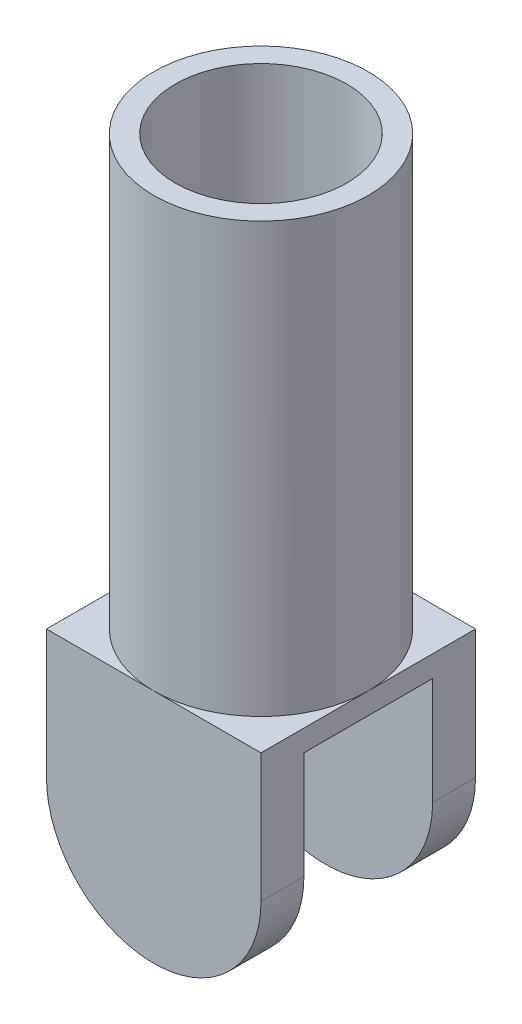
ISO-10303-21;
HEADER;
FILE_DESCRIPTION(('STEP AP214'),'2;1');
FILE_NAME('part.step','',(''),(''),'','','');
FILE_SCHEMA(('AUTOMOTIVE_DESIGN { 1 0 10303 214 1 1 1 1 }'));
ENDSEC;
DATA;
#1=APPLICATION_CONTEXT('core data for automotive mechanical design processes');
#2=APPLICATION_PROTOCOL_DEFINITION('international standard','automotive_design',2000,#1);
#3=PRODUCT_CONTEXT('',#1,'mechanical');
#4=PRODUCT('Part','Part','',(#3));
#5=PRODUCT_RELATED_PRODUCT_CATEGORY('part','',(#4));
#6=PRODUCT_DEFINITION_FORMATION('','',#4);
#7=PRODUCT_DEFINITION_CONTEXT('part definition',#1,'design');
#8=PRODUCT_DEFINITION('design','',#6,#7);
#9=PRODUCT_DEFINITION_SHAPE('','',#8);
#10=(LENGTH_UNIT() NAMED_UNIT(*) SI_UNIT(.MILLI.,.METRE.));
#11=(NAMED_UNIT(*) PLANE_ANGLE_UNIT() SI_UNIT($,.RADIAN.));
#12=(NAMED_UNIT(*) SI_UNIT($,.STERADIAN.) SOLID_ANGLE_UNIT());
#13=UNCERTAINTY_MEASURE_WITH_UNIT(LENGTH_MEASURE(1.E-05),#10,'distance_accuracy_value','');
#14=(GEOMETRIC_REPRESENTATION_CONTEXT(3) GLOBAL_UNCERTAINTY_ASSIGNED_CONTEXT((#13)) GLOBAL_UNIT_ASSIGNED_CONTEXT((#10,
#11,#12)) REPRESENTATION_CONTEXT('',''));
#15=CARTESIAN_POINT('',(0.,0.,0.));
#16=DIRECTION('',(0.,0.,1.));
#17=DIRECTION('',(1.,0.,0.));
#18=AXIS2_PLACEMENT_3D('',#15,#16,#17);
#19=CARTESIAN_POINT('',(-5.,11.,-5.));
#20=DIRECTION('',(1.,0.,0.));
#21=DIRECTION('',(0.,0.,-1.));
#22=AXIS2_PLACEMENT_3D('',#19,#20,#21);
#23=PLANE('',#22);
#24=DIRECTION('',(0.,0.,1.));
#25=VECTOR('',#24,1.);
#26=CARTESIAN_POINT('',(-5.,5.,-55.));
#27=LINE('',#26,#25);
#28=CARTESIAN_POINT('',(-5.,5.,3.));
#29=VERTEX_POINT('',#28);
#30=CARTESIAN_POINT('',(-5.,5.,5.));
#31=VERTEX_POINT('',#30);
#32=EDGE_CURVE('E50',#29,#31,#27,.T.);
#33=ORIENTED_EDGE('',*,*,#32,.T.);
#34=DIRECTION('',(0.,-1.,0.));
#35=VECTOR('',#34,1.);
#36=CARTESIAN_POINT('',(-5.,11.,5.));
#37=LINE('',#36,#35);
#38=CARTESIAN_POINT('',(-5.,11.,5.));
#39=VERTEX_POINT('',#38);
#40=EDGE_CURVE('E122',#39,#31,#37,.T.);
#41=ORIENTED_EDGE('',*,*,#40,.F.);
#42=DIRECTION('',(0.,0.,1.));
#43=VECTOR('',#42,1.);
#44=CARTESIAN_POINT('',(-5.,11.,-5.));
#45=LINE('',#44,#43);
#46=CARTESIAN_POINT('',(-5.,11.,0.));
#47=VERTEX_POINT('',#46);
#48=EDGE_CURVE('E157',#47,#39,#45,.T.);
#49=ORIENTED_EDGE('',*,*,#48,.F.);
#50=CARTESIAN_POINT('',(-5.,11.,-5.));
#51=VERTEX_POINT('',#50);
#52=EDGE_CURVE('E155',#51,#47,#45,.T.);
#53=ORIENTED_EDGE('',*,*,#52,.F.);
#54=DIRECTION('',(0.,-1.,0.));
#55=VECTOR('',#54,1.);
#56=CARTESIAN_POINT('',(-5.,11.,-5.));
#57=LINE('',#56,#55);
#58=CARTESIAN_POINT('',(-5.,5.,-5.00000000000001));
#59=VERTEX_POINT('',#58);
#60=EDGE_CURVE('E142',#51,#59,#57,.T.);
#61=ORIENTED_EDGE('',*,*,#60,.T.);
#62=CARTESIAN_POINT('',(-5.,5.,-3.00000000000002));
#63=VERTEX_POINT('',#62);
#64=EDGE_CURVE('E125',#59,#63,#27,.T.);
#65=ORIENTED_EDGE('',*,*,#64,.T.);
#66=DIRECTION('',(0.,1.,0.));
#67=VECTOR('',#66,1.);
#68=CARTESIAN_POINT('',(-5.,11.,-3.));
#69=LINE('',#68,#67);
#70=CARTESIAN_POINT('',(-5.00000000000002,10.,-3.));
#71=VERTEX_POINT('',#70);
#72=EDGE_CURVE('E172',#63,#71,#69,.T.);
#73=ORIENTED_EDGE('',*,*,#72,.T.);
#74=DIRECTION('',(0.,0.,1.));
#75=VECTOR('',#74,1.);
#76=CARTESIAN_POINT('',(-5.,10.,-5.));
#77=LINE('',#76,#75);
#78=CARTESIAN_POINT('',(-5.00000000000002,10.,3.));
#79=VERTEX_POINT('',#78);
#80=EDGE_CURVE('E167',#71,#79,#77,.T.);
#81=ORIENTED_EDGE('',*,*,#80,.T.);
#82=DIRECTION('',(0.,-1.,0.));
#83=VECTOR('',#82,1.);
#84=CARTESIAN_POINT('',(-5.,11.,3.));
#85=LINE('',#84,#83);
#86=EDGE_CURVE('E124',#79,#29,#85,.T.);
#87=ORIENTED_EDGE('',*,*,#86,.T.);
#88=EDGE_LOOP('',(#33,#41,#49,#53,#61,#65,#73,#81,#87));
#89=FACE_BOUND('',#88,.T.);
#90=ADVANCED_FACE('F36',(#89),#23,.F.);
#91=CARTESIAN_POINT('',(0.,11.,0.));
#92=DIRECTION('',(0.,1.,0.));
#93=DIRECTION('',(0.,0.,1.));
#94=AXIS2_PLACEMENT_3D('',#91,#92,#93);
#95=PLANE('',#94);
#96=CARTESIAN_POINT('',(0.,11.,0.));
#97=DIRECTION('',(0.,1.,0.));
#98=DIRECTION('',(0.,0.,1.));
#99=AXIS2_PLACEMENT_3D('',#96,#97,#98);
#100=CIRCLE('',#99,5.);
#101=CARTESIAN_POINT('',(0.,11.,5.));
#102=VERTEX_POINT('',#101);
#103=CARTESIAN_POINT('',(5.,11.,0.));
#104=VERTEX_POINT('',#103);
#105=EDGE_CURVE('E136',#102,#104,#100,.T.);
#106=ORIENTED_EDGE('',*,*,#105,.F.);
#107=DIRECTION('',(1.,0.,0.));
#108=VECTOR('',#107,1.);
#109=CARTESIAN_POINT('',(-5.,11.,5.));
#110=LINE('',#109,#108);
#111=CARTESIAN_POINT('',(5.,11.,5.));
#112=VERTEX_POINT('',#111);
#113=EDGE_CURVE('E154',#102,#112,#110,.T.);
#114=ORIENTED_EDGE('',*,*,#113,.T.);
#115=DIRECTION('',(0.,0.,-1.));
#116=VECTOR('',#115,1.);
#117=CARTESIAN_POINT('',(5.,11.,-5.));
#118=LINE('',#117,#116);
#119=EDGE_CURVE('E149',#112,#104,#118,.T.);
#120=ORIENTED_EDGE('',*,*,#119,.T.);
#121=EDGE_LOOP('',(#106,#114,#120));
#122=FACE_BOUND('',#121,.T.);
#123=ADVANCED_FACE('F222',(#122),#95,.T.);
#124=CARTESIAN_POINT('',(0.,11.,-5.));
#125=VERTEX_POINT('',#124);
#126=EDGE_CURVE('E43',#104,#125,#100,.T.);
#127=ORIENTED_EDGE('',*,*,#126,.F.);
#128=CARTESIAN_POINT('',(5.,11.,-5.));
#129=VERTEX_POINT('',#128);
#130=EDGE_CURVE('E152',#104,#129,#118,.T.);
#131=ORIENTED_EDGE('',*,*,#130,.T.);
#132=DIRECTION('',(-1.,0.,0.));
#133=VECTOR('',#132,1.);
#134=CARTESIAN_POINT('',(-5.,11.,-5.));
#135=LINE('',#134,#133);
#136=EDGE_CURVE('E145',#129,#125,#135,.T.);
#137=ORIENTED_EDGE('',*,*,#136,.T.);
#138=EDGE_LOOP('',(#127,#131,#137));
#139=FACE_BOUND('',#138,.T.);
#140=ADVANCED_FACE('F226',(#139),#95,.T.);
#141=EDGE_CURVE('E134',#125,#47,#100,.T.);
#142=ORIENTED_EDGE('',*,*,#141,.F.);
#143=EDGE_CURVE('E148',#125,#51,#135,.T.);
#144=ORIENTED_EDGE('',*,*,#143,.T.);
#145=ORIENTED_EDGE('',*,*,#52,.T.);
#146=EDGE_LOOP('',(#142,#144,#145));
#147=FACE_BOUND('',#146,.T.);
#148=ADVANCED_FACE('F233',(#147),#95,.T.);
#149=CARTESIAN_POINT('',(-5.,11.,5.));
#150=DIRECTION('',(0.,0.,-1.));
#151=DIRECTION('',(-1.,0.,0.));
#152=AXIS2_PLACEMENT_3D('',#149,#150,#151);
#153=PLANE('',#152);
#154=ORIENTED_EDGE('',*,*,#40,.T.);
#155=CARTESIAN_POINT('',(0.,5.,5.));
#156=DIRECTION('',(0.,0.,-1.));
#157=DIRECTION('',(1.,0.,0.));
#158=AXIS2_PLACEMENT_3D('',#155,#156,#157);
#159=CIRCLE('',#158,5.);
#160=CARTESIAN_POINT('',(5.,5.,5.));
#161=VERTEX_POINT('',#160);
#162=EDGE_CURVE('E109',#161,#31,#159,.T.);
#163=ORIENTED_EDGE('',*,*,#162,.F.);
#164=DIRECTION('',(0.,-1.,0.));
#165=VECTOR('',#164,1.);
#166=CARTESIAN_POINT('',(5.,11.,5.));
#167=LINE('',#166,#165);
#168=EDGE_CURVE('E132',#112,#161,#167,.T.);
#169=ORIENTED_EDGE('',*,*,#168,.F.);
#170=ORIENTED_EDGE('',*,*,#113,.F.);
#171=EDGE_CURVE('E130',#39,#102,#110,.T.);
#172=ORIENTED_EDGE('',*,*,#171,.F.);
#173=EDGE_LOOP('',(#154,#163,#169,#170,#172));
#174=FACE_BOUND('',#173,.T.);
#175=ADVANCED_FACE('F128',(#174),#153,.F.);
#176=CARTESIAN_POINT('',(5.,11.,-5.));
#177=DIRECTION('',(-1.,0.,0.));
#178=DIRECTION('',(0.,0.,1.));
#179=AXIS2_PLACEMENT_3D('',#176,#177,#178);
#180=PLANE('',#179);
#181=ORIENTED_EDGE('',*,*,#168,.T.);
#182=DIRECTION('',(0.,0.,1.));
#183=VECTOR('',#182,1.);
#184=CARTESIAN_POINT('',(5.,5.,-55.));
#185=LINE('',#184,#183);
#186=CARTESIAN_POINT('',(5.,5.,2.99999999999999));
#187=VERTEX_POINT('',#186);
#188=EDGE_CURVE('E112',#187,#161,#185,.T.);
#189=ORIENTED_EDGE('',*,*,#188,.F.);
#190=DIRECTION('',(0.,-1.,0.));
#191=VECTOR('',#190,1.);
#192=CARTESIAN_POINT('',(5.,0.,3.));
#193=LINE('',#192,#191);
#194=CARTESIAN_POINT('',(5.,10.,3.));
#195=VERTEX_POINT('',#194);
#196=EDGE_CURVE('E184',#195,#187,#193,.T.);
#197=ORIENTED_EDGE('',*,*,#196,.F.);
#198=DIRECTION('',(0.,0.,1.));
#199=VECTOR('',#198,1.);
#200=CARTESIAN_POINT('',(5.,10.,3.));
#201=LINE('',#200,#199);
#202=CARTESIAN_POINT('',(5.,10.,-3.));
#203=VERTEX_POINT('',#202);
#204=EDGE_CURVE('E178',#203,#195,#201,.T.);
#205=ORIENTED_EDGE('',*,*,#204,.F.);
#206=DIRECTION('',(0.,1.,0.));
#207=VECTOR('',#206,1.);
#208=CARTESIAN_POINT('',(5.,0.,-3.));
#209=LINE('',#208,#207);
#210=CARTESIAN_POINT('',(5.,5.,-3.));
#211=VERTEX_POINT('',#210);
#212=EDGE_CURVE('E182',#211,#203,#209,.T.);
#213=ORIENTED_EDGE('',*,*,#212,.F.);
#214=CARTESIAN_POINT('',(5.,5.,-5.00000000000001));
#215=VERTEX_POINT('',#214);
#216=EDGE_CURVE('E58',#215,#211,#185,.T.);
#217=ORIENTED_EDGE('',*,*,#216,.F.);
#218=DIRECTION('',(0.,-1.,0.));
#219=VECTOR('',#218,1.);
#220=CARTESIAN_POINT('',(5.,11.,-5.));
#221=LINE('',#220,#219);
#222=EDGE_CURVE('E137',#129,#215,#221,.T.);
#223=ORIENTED_EDGE('',*,*,#222,.F.);
#224=ORIENTED_EDGE('',*,*,#130,.F.);
#225=ORIENTED_EDGE('',*,*,#119,.F.);
#226=EDGE_LOOP('',(#181,#189,#197,#205,#213,#217,#223,#224,#225));
#227=FACE_BOUND('',#226,.T.);
#228=ADVANCED_FACE('F207',(#227),#180,.F.);
#229=CARTESIAN_POINT('',(-5.,11.,-5.));
#230=DIRECTION('',(0.,0.,1.));
#231=DIRECTION('',(1.,0.,0.));
#232=AXIS2_PLACEMENT_3D('',#229,#230,#231);
#233=PLANE('',#232);
#234=ORIENTED_EDGE('',*,*,#222,.T.);
#235=CARTESIAN_POINT('',(0.,5.,-5.));
#236=DIRECTION('',(0.,0.,1.));
#237=DIRECTION('',(1.,0.,0.));
#238=AXIS2_PLACEMENT_3D('',#235,#236,#237);
#239=CIRCLE('',#238,5.);
#240=EDGE_CURVE('E187',#215,#59,#239,.F.);
#241=ORIENTED_EDGE('',*,*,#240,.T.);
#242=ORIENTED_EDGE('',*,*,#60,.F.);
#243=ORIENTED_EDGE('',*,*,#143,.F.);
#244=ORIENTED_EDGE('',*,*,#136,.F.);
#245=EDGE_LOOP('',(#234,#241,#242,#243,#244));
#246=FACE_BOUND('',#245,.T.);
#247=ADVANCED_FACE('F240',(#246),#233,.F.);
#248=EDGE_CURVE('E131',#47,#102,#100,.T.);
#249=ORIENTED_EDGE('',*,*,#248,.F.);
#250=ORIENTED_EDGE('',*,*,#48,.T.);
#251=ORIENTED_EDGE('',*,*,#171,.T.);
#252=EDGE_LOOP('',(#249,#250,#251));
#253=FACE_BOUND('',#252,.T.);
#254=ADVANCED_FACE('F229',(#253),#95,.T.);
#255=CARTESIAN_POINT('',(0.,31.,0.));
#256=DIRECTION('',(0.,1.,0.));
#257=DIRECTION('',(0.,0.,1.));
#258=AXIS2_PLACEMENT_3D('',#255,#256,#257);
#259=PLANE('',#258);
#260=CARTESIAN_POINT('',(0.,31.,0.));
#261=DIRECTION('',(0.,1.,0.));
#262=DIRECTION('',(0.,0.,1.));
#263=AXIS2_PLACEMENT_3D('',#260,#261,#262);
#264=CIRCLE('',#263,5.);
#265=CARTESIAN_POINT('',(0.,31.,5.));
#266=VERTEX_POINT('',#265);
#267=EDGE_CURVE('E160',#266,#266,#264,.T.);
#268=ORIENTED_EDGE('',*,*,#267,.T.);
#269=EDGE_LOOP('',(#268));
#270=FACE_BOUND('',#269,.T.);
#271=CARTESIAN_POINT('',(0.,31.,0.));
#272=DIRECTION('',(0.,1.,0.));
#273=DIRECTION('',(0.,0.,1.));
#274=AXIS2_PLACEMENT_3D('',#271,#272,#273);
#275=CIRCLE('',#274,4.);
#276=CARTESIAN_POINT('',(0.,31.,4.));
#277=VERTEX_POINT('',#276);
#278=EDGE_CURVE('E161',#277,#277,#275,.T.);
#279=ORIENTED_EDGE('',*,*,#278,.F.);
#280=EDGE_LOOP('',(#279));
#281=FACE_BOUND('',#280,.T.);
#282=ADVANCED_FACE('F239',(#270,#281),#259,.T.);
#283=CARTESIAN_POINT('',(0.,31.,0.));
#284=DIRECTION('',(0.,-1.,0.));
#285=DIRECTION('',(0.,0.,-1.));
#286=AXIS2_PLACEMENT_3D('',#283,#284,#285);
#287=CYLINDRICAL_SURFACE('',#286,5.);
#288=ORIENTED_EDGE('',*,*,#267,.F.);
#289=EDGE_LOOP('',(#288));
#290=FACE_BOUND('',#289,.T.);
#291=ORIENTED_EDGE('',*,*,#105,.T.);
#292=ORIENTED_EDGE('',*,*,#126,.T.);
#293=ORIENTED_EDGE('',*,*,#141,.T.);
#294=ORIENTED_EDGE('',*,*,#248,.T.);
#295=EDGE_LOOP('',(#291,#292,#293,#294));
#296=FACE_BOUND('',#295,.T.);
#297=ADVANCED_FACE('F246',(#290,#296),#287,.T.);
#298=CARTESIAN_POINT('',(0.,31.,0.));
#299=DIRECTION('',(0.,-1.,0.));
#300=DIRECTION('',(0.,0.,-1.));
#301=AXIS2_PLACEMENT_3D('',#298,#299,#300);
#302=CYLINDRICAL_SURFACE('',#301,4.);
#303=ORIENTED_EDGE('',*,*,#278,.T.);
#304=EDGE_LOOP('',(#303));
#305=FACE_BOUND('',#304,.T.);
#306=CARTESIAN_POINT('',(0.,11.,0.));
#307=DIRECTION('',(0.,1.,0.));
#308=DIRECTION('',(0.,0.,1.));
#309=AXIS2_PLACEMENT_3D('',#306,#307,#308);
#310=CIRCLE('',#309,4.);
#311=CARTESIAN_POINT('',(0.,11.,4.));
#312=VERTEX_POINT('',#311);
#313=EDGE_CURVE('E164',#312,#312,#310,.T.);
#314=ORIENTED_EDGE('',*,*,#313,.F.);
#315=EDGE_LOOP('',(#314));
#316=FACE_BOUND('',#315,.T.);
#317=ADVANCED_FACE('F251',(#305,#316),#302,.F.);
#318=ORIENTED_EDGE('',*,*,#313,.T.);
#319=EDGE_LOOP('',(#318));
#320=FACE_BOUND('',#319,.T.);
#321=ADVANCED_FACE('F218',(#320),#95,.T.);
#322=CARTESIAN_POINT('',(-55.,10.,3.));
#323=DIRECTION('',(0.,1.,0.));
#324=DIRECTION('',(0.,0.,1.));
#325=AXIS2_PLACEMENT_3D('',#322,#323,#324);
#326=PLANE('',#325);
#327=DIRECTION('',(1.,0.,0.));
#328=VECTOR('',#327,1.);
#329=CARTESIAN_POINT('',(-55.,10.,-3.));
#330=LINE('',#329,#328);
#331=EDGE_CURVE('E175',#71,#203,#330,.T.);
#332=ORIENTED_EDGE('',*,*,#331,.T.);
#333=ORIENTED_EDGE('',*,*,#204,.T.);
#334=DIRECTION('',(1.,0.,0.));
#335=VECTOR('',#334,1.);
#336=CARTESIAN_POINT('',(-55.,10.,3.));
#337=LINE('',#336,#335);
#338=EDGE_CURVE('E174',#79,#195,#337,.T.);
#339=ORIENTED_EDGE('',*,*,#338,.F.);
#340=ORIENTED_EDGE('',*,*,#80,.F.);
#341=EDGE_LOOP('',(#332,#333,#339,#340));
#342=FACE_BOUND('',#341,.T.);
#343=ADVANCED_FACE('F203',(#342),#326,.F.);
#344=CARTESIAN_POINT('',(-55.,0.,3.));
#345=DIRECTION('',(0.,0.,1.));
#346=DIRECTION('',(1.,0.,0.));
#347=AXIS2_PLACEMENT_3D('',#344,#345,#346);
#348=PLANE('',#347);
#349=ORIENTED_EDGE('',*,*,#196,.T.);
#350=CARTESIAN_POINT('',(0.,5.,3.));
#351=DIRECTION('',(0.,0.,1.));
#352=DIRECTION('',(1.,0.,0.));
#353=AXIS2_PLACEMENT_3D('',#350,#351,#352);
#354=CIRCLE('',#353,5.);
#355=EDGE_CURVE('E189',#187,#29,#354,.F.);
#356=ORIENTED_EDGE('',*,*,#355,.T.);
#357=ORIENTED_EDGE('',*,*,#86,.F.);
#358=ORIENTED_EDGE('',*,*,#338,.T.);
#359=EDGE_LOOP('',(#349,#356,#357,#358));
#360=FACE_BOUND('',#359,.T.);
#361=ADVANCED_FACE('F209',(#360),#348,.F.);
#362=CARTESIAN_POINT('',(-55.,0.,-3.));
#363=DIRECTION('',(0.,0.,-1.));
#364=DIRECTION('',(-1.,0.,0.));
#365=AXIS2_PLACEMENT_3D('',#362,#363,#364);
#366=PLANE('',#365);
#367=ORIENTED_EDGE('',*,*,#72,.F.);
#368=CARTESIAN_POINT('',(0.,5.,-3.));
#369=DIRECTION('',(0.,0.,-1.));
#370=DIRECTION('',(-1.,0.,0.));
#371=AXIS2_PLACEMENT_3D('',#368,#369,#370);
#372=CIRCLE('',#371,5.);
#373=EDGE_CURVE('E11',#63,#211,#372,.F.);
#374=ORIENTED_EDGE('',*,*,#373,.T.);
#375=ORIENTED_EDGE('',*,*,#212,.T.);
#376=ORIENTED_EDGE('',*,*,#331,.F.);
#377=EDGE_LOOP('',(#367,#374,#375,#376));
#378=FACE_BOUND('',#377,.T.);
#379=ADVANCED_FACE('F199',(#378),#366,.F.);
#380=CARTESIAN_POINT('',(0.,5.,-55.));
#381=DIRECTION('',(0.,0.,1.));
#382=DIRECTION('',(1.,0.,0.));
#383=AXIS2_PLACEMENT_3D('',#380,#381,#382);
#384=CYLINDRICAL_SURFACE('',#383,5.);
#385=ORIENTED_EDGE('',*,*,#216,.T.);
#386=ORIENTED_EDGE('',*,*,#373,.F.);
#387=ORIENTED_EDGE('',*,*,#64,.F.);
#388=ORIENTED_EDGE('',*,*,#240,.F.);
#389=EDGE_LOOP('',(#385,#386,#387,#388));
#390=FACE_BOUND('',#389,.T.);
#391=ADVANCED_FACE('F216',(#390),#384,.T.);
#392=ORIENTED_EDGE('',*,*,#162,.T.);
#393=ORIENTED_EDGE('',*,*,#32,.F.);
#394=ORIENTED_EDGE('',*,*,#355,.F.);
#395=ORIENTED_EDGE('',*,*,#188,.T.);
#396=EDGE_LOOP('',(#392,#393,#394,#395));
#397=FACE_BOUND('',#396,.T.);
#398=ADVANCED_FACE('F110',(#397),#384,.T.);
#399=CLOSED_SHELL('',(#90,#123,#140,#148,#175,#228,#247,#254,#282,#297,#317,#321,#343,#361,#379,
#391,#398));
#400=MANIFOLD_SOLID_BREP('B2',#399);
#401=ADVANCED_BREP_SHAPE_REPRESENTATION('',(#18,#400),#14);
#402=SHAPE_DEFINITION_REPRESENTATION(#9,#401);
ENDSEC;
END-ISO-10303-21;
